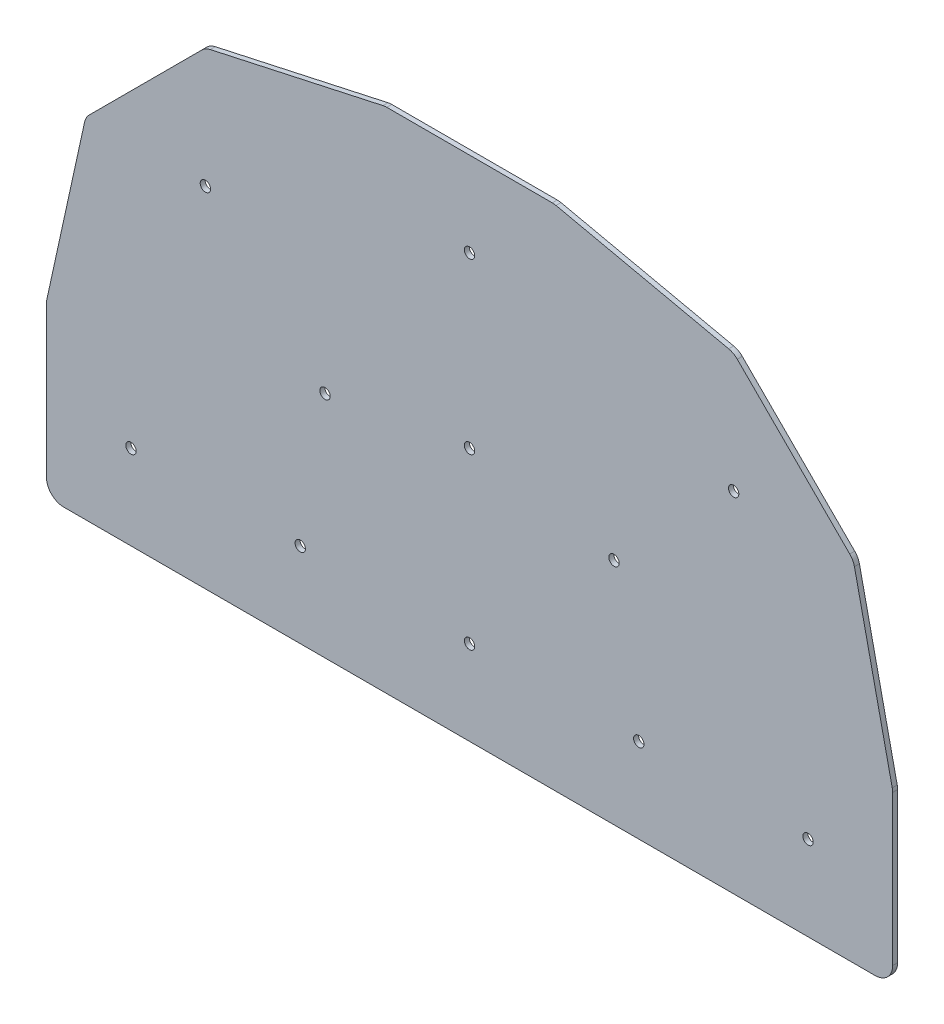
ISO-10303-21;
HEADER;
FILE_DESCRIPTION(('STEP AP214'),'2;1');
FILE_NAME('part.step','',(''),(''),'','','');
FILE_SCHEMA(('AUTOMOTIVE_DESIGN { 1 0 10303 214 1 1 1 1 }'));
ENDSEC;
DATA;
#1=APPLICATION_CONTEXT('core data for automotive mechanical design processes');
#2=APPLICATION_PROTOCOL_DEFINITION('international standard','automotive_design',2000,#1);
#3=PRODUCT_CONTEXT('',#1,'mechanical');
#4=PRODUCT('Part','Part','',(#3));
#5=PRODUCT_RELATED_PRODUCT_CATEGORY('part','',(#4));
#6=PRODUCT_DEFINITION_FORMATION('','',#4);
#7=PRODUCT_DEFINITION_CONTEXT('part definition',#1,'design');
#8=PRODUCT_DEFINITION('design','',#6,#7);
#9=PRODUCT_DEFINITION_SHAPE('','',#8);
#10=(LENGTH_UNIT() NAMED_UNIT(*) SI_UNIT(.MILLI.,.METRE.));
#11=(NAMED_UNIT(*) PLANE_ANGLE_UNIT() SI_UNIT($,.RADIAN.));
#12=(NAMED_UNIT(*) SI_UNIT($,.STERADIAN.) SOLID_ANGLE_UNIT());
#13=UNCERTAINTY_MEASURE_WITH_UNIT(LENGTH_MEASURE(1.E-05),#10,'distance_accuracy_value','');
#14=(GEOMETRIC_REPRESENTATION_CONTEXT(3) GLOBAL_UNCERTAINTY_ASSIGNED_CONTEXT((#13)) GLOBAL_UNIT_ASSIGNED_CONTEXT((#10,
#11,#12)) REPRESENTATION_CONTEXT('',''));
#15=CARTESIAN_POINT('',(0.,0.,0.));
#16=DIRECTION('',(0.,0.,1.));
#17=DIRECTION('',(1.,0.,0.));
#18=AXIS2_PLACEMENT_3D('',#15,#16,#17);
#19=CARTESIAN_POINT('',(129.38125,5.55625,1.5875));
#20=DIRECTION('',(0.,0.,-1.));
#21=DIRECTION('',(-1.,0.,0.));
#22=AXIS2_PLACEMENT_3D('',#19,#20,#21);
#23=CYLINDRICAL_SURFACE('',#22,5.55624999999999);
#24=CARTESIAN_POINT('',(129.38125,5.55625,0.));
#25=DIRECTION('',(0.,0.,-1.));
#26=DIRECTION('',(-1.,0.,0.));
#27=AXIS2_PLACEMENT_3D('',#24,#25,#26);
#28=CIRCLE('',#27,5.55624999999999);
#29=CARTESIAN_POINT('',(134.9375,5.55625,0.));
#30=VERTEX_POINT('',#29);
#31=CARTESIAN_POINT('',(129.38125,0.,0.));
#32=VERTEX_POINT('',#31);
#33=EDGE_CURVE('E201',#30,#32,#28,.T.);
#34=ORIENTED_EDGE('',*,*,#33,.F.);
#35=DIRECTION('',(0.,0.,-1.));
#36=VECTOR('',#35,1.);
#37=CARTESIAN_POINT('',(134.9375,5.55625,1.5875));
#38=LINE('',#37,#36);
#39=CARTESIAN_POINT('',(134.9375,5.55625,1.5875));
#40=VERTEX_POINT('',#39);
#41=EDGE_CURVE('E11',#40,#30,#38,.T.);
#42=ORIENTED_EDGE('',*,*,#41,.F.);
#43=CARTESIAN_POINT('',(129.38125,5.55625,1.5875));
#44=DIRECTION('',(0.,0.,-1.));
#45=DIRECTION('',(-1.,0.,0.));
#46=AXIS2_PLACEMENT_3D('',#43,#44,#45);
#47=CIRCLE('',#46,5.55624999999999);
#48=CARTESIAN_POINT('',(129.38125,0.,1.5875));
#49=VERTEX_POINT('',#48);
#50=EDGE_CURVE('E258',#40,#49,#47,.T.);
#51=ORIENTED_EDGE('',*,*,#50,.T.);
#52=DIRECTION('',(0.,0.,-1.));
#53=VECTOR('',#52,1.);
#54=CARTESIAN_POINT('',(129.38125,0.,1.5875));
#55=LINE('',#54,#53);
#56=EDGE_CURVE('E35',#49,#32,#55,.T.);
#57=ORIENTED_EDGE('',*,*,#56,.T.);
#58=EDGE_LOOP('',(#34,#42,#51,#57));
#59=FACE_BOUND('',#58,.T.);
#60=ADVANCED_FACE('F32',(#59),#23,.T.);
#61=CARTESIAN_POINT('',(134.9375,53.3738460334,1.5875));
#62=DIRECTION('',(1.,0.,0.));
#63=DIRECTION('',(0.,0.,-1.));
#64=AXIS2_PLACEMENT_3D('',#61,#62,#63);
#65=PLANE('',#64);
#66=DIRECTION('',(0.,-1.,0.));
#67=VECTOR('',#66,1.);
#68=CARTESIAN_POINT('',(134.9375,53.3738460334,0.));
#69=LINE('',#68,#67);
#70=CARTESIAN_POINT('',(134.9375,53.3738460334,0.));
#71=VERTEX_POINT('',#70);
#72=EDGE_CURVE('E256',#71,#30,#69,.T.);
#73=ORIENTED_EDGE('',*,*,#72,.F.);
#74=DIRECTION('',(0.,0.,-1.));
#75=VECTOR('',#74,1.);
#76=CARTESIAN_POINT('',(134.9375,53.3738460334,1.5875));
#77=LINE('',#76,#75);
#78=CARTESIAN_POINT('',(134.9375,53.3738460334,1.5875));
#79=VERTEX_POINT('',#78);
#80=EDGE_CURVE('E41',#79,#71,#77,.T.);
#81=ORIENTED_EDGE('',*,*,#80,.F.);
#82=DIRECTION('',(0.,-1.,0.));
#83=VECTOR('',#82,1.);
#84=CARTESIAN_POINT('',(134.9375,53.3738460334,1.5875));
#85=LINE('',#84,#83);
#86=EDGE_CURVE('E191',#79,#40,#85,.T.);
#87=ORIENTED_EDGE('',*,*,#86,.T.);
#88=ORIENTED_EDGE('',*,*,#41,.T.);
#89=EDGE_LOOP('',(#73,#81,#87,#88));
#90=FACE_BOUND('',#89,.T.);
#91=ADVANCED_FACE('F294',(#90),#65,.T.);
#92=CARTESIAN_POINT('',(129.381249994601,53.3738460334,1.5875));
#93=DIRECTION('',(0.,0.,-1.));
#94=DIRECTION('',(-1.,0.,0.));
#95=AXIS2_PLACEMENT_3D('',#92,#93,#94);
#96=CYLINDRICAL_SURFACE('',#95,5.55625000539878);
#97=CARTESIAN_POINT('',(129.381249994601,53.3738460334,0.));
#98=DIRECTION('',(0.,0.,-1.));
#99=DIRECTION('',(-1.,0.,0.));
#100=AXIS2_PLACEMENT_3D('',#97,#98,#99);
#101=CIRCLE('',#100,5.55625000539878);
#102=CARTESIAN_POINT('',(134.808922399283,54.5622425959787,0.));
#103=VERTEX_POINT('',#102);
#104=EDGE_CURVE('E178',#103,#71,#101,.T.);
#105=ORIENTED_EDGE('',*,*,#104,.F.);
#106=DIRECTION('',(0.,0.,-1.));
#107=VECTOR('',#106,1.);
#108=CARTESIAN_POINT('',(134.808922399283,54.5622425959787,1.5875));
#109=LINE('',#108,#107);
#110=CARTESIAN_POINT('',(134.808922399283,54.5622425959787,1.5875));
#111=VERTEX_POINT('',#110);
#112=EDGE_CURVE('E173',#111,#103,#109,.T.);
#113=ORIENTED_EDGE('',*,*,#112,.F.);
#114=CARTESIAN_POINT('',(129.381249994601,53.3738460334,1.5875));
#115=DIRECTION('',(0.,0.,-1.));
#116=DIRECTION('',(-1.,0.,0.));
#117=AXIS2_PLACEMENT_3D('',#114,#115,#116);
#118=CIRCLE('',#117,5.55625000539878);
#119=EDGE_CURVE('E176',#111,#79,#118,.T.);
#120=ORIENTED_EDGE('',*,*,#119,.T.);
#121=ORIENTED_EDGE('',*,*,#80,.T.);
#122=EDGE_LOOP('',(#105,#113,#120,#121));
#123=FACE_BOUND('',#122,.T.);
#124=ADVANCED_FACE('F175',(#123),#96,.T.);
#125=CARTESIAN_POINT('',(122.750794564556,109.634404331843,1.5875));
#126=DIRECTION('',(0.976858924527881,0.213884645475622,0.));
#127=DIRECTION('',(-0.213884645475622,0.97685892452788,0.));
#128=AXIS2_PLACEMENT_3D('',#125,#126,#127);
#129=PLANE('',#128);
#130=DIRECTION('',(0.213884645475622,-0.97685892452788,0.));
#131=VECTOR('',#130,1.);
#132=CARTESIAN_POINT('',(122.750794564556,109.634404331843,0.));
#133=LINE('',#132,#131);
#134=CARTESIAN_POINT('',(122.750794564556,109.634404331843,0.));
#135=VERTEX_POINT('',#134);
#136=EDGE_CURVE('E253',#135,#103,#133,.T.);
#137=ORIENTED_EDGE('',*,*,#136,.F.);
#138=DIRECTION('',(0.,0.,-1.));
#139=VECTOR('',#138,1.);
#140=CARTESIAN_POINT('',(122.750794564556,109.634404331843,1.5875));
#141=LINE('',#140,#139);
#142=CARTESIAN_POINT('',(122.750794564556,109.634404331843,1.5875));
#143=VERTEX_POINT('',#142);
#144=EDGE_CURVE('E183',#143,#135,#141,.T.);
#145=ORIENTED_EDGE('',*,*,#144,.F.);
#146=DIRECTION('',(0.213884645475622,-0.97685892452788,0.));
#147=VECTOR('',#146,1.);
#148=CARTESIAN_POINT('',(122.750794564556,109.634404331843,1.5875));
#149=LINE('',#148,#147);
#150=EDGE_CURVE('E189',#143,#111,#149,.T.);
#151=ORIENTED_EDGE('',*,*,#150,.T.);
#152=ORIENTED_EDGE('',*,*,#112,.T.);
#153=EDGE_LOOP('',(#137,#145,#151,#152));
#154=FACE_BOUND('',#153,.T.);
#155=ADVANCED_FACE('F193',(#154),#129,.T.);
#156=CARTESIAN_POINT('',(117.323122161812,108.446007769689,1.5875));
#157=DIRECTION('',(0.,0.,-1.));
#158=DIRECTION('',(-1.,0.,0.));
#159=AXIS2_PLACEMENT_3D('',#156,#157,#158);
#160=CYLINDRICAL_SURFACE('',#159,5.55625000341466);
#161=CARTESIAN_POINT('',(117.323122161812,108.446007769689,0.));
#162=DIRECTION('',(0.,0.,-1.));
#163=DIRECTION('',(-1.,0.,0.));
#164=AXIS2_PLACEMENT_3D('',#161,#162,#163);
#165=CIRCLE('',#164,5.55625000341466);
#166=CARTESIAN_POINT('',(121.251984217194,112.374869825071,0.));
#167=VERTEX_POINT('',#166);
#168=EDGE_CURVE('E250',#167,#135,#165,.T.);
#169=ORIENTED_EDGE('',*,*,#168,.F.);
#170=DIRECTION('',(0.,0.,-1.));
#171=VECTOR('',#170,1.);
#172=CARTESIAN_POINT('',(121.251984217194,112.374869825071,1.5875));
#173=LINE('',#172,#171);
#174=CARTESIAN_POINT('',(121.251984217194,112.374869825071,1.5875));
#175=VERTEX_POINT('',#174);
#176=EDGE_CURVE('E262',#175,#167,#173,.T.);
#177=ORIENTED_EDGE('',*,*,#176,.F.);
#178=CARTESIAN_POINT('',(117.323122161812,108.446007769689,1.5875));
#179=DIRECTION('',(0.,0.,-1.));
#180=DIRECTION('',(-1.,0.,0.));
#181=AXIS2_PLACEMENT_3D('',#178,#179,#180);
#182=CIRCLE('',#181,5.55625000341466);
#183=EDGE_CURVE('E194',#175,#143,#182,.T.);
#184=ORIENTED_EDGE('',*,*,#183,.T.);
#185=ORIENTED_EDGE('',*,*,#144,.T.);
#186=EDGE_LOOP('',(#169,#177,#184,#185));
#187=FACE_BOUND('',#186,.T.);
#188=ADVANCED_FACE('F307',(#187),#160,.T.);
#189=CARTESIAN_POINT('',(85.3873698149944,148.239484227271,1.5875));
#190=DIRECTION('',(0.707106781186547,0.707106781186548,0.));
#191=DIRECTION('',(-0.707106781186548,0.707106781186547,0.));
#192=AXIS2_PLACEMENT_3D('',#189,#190,#191);
#193=PLANE('',#192);
#194=DIRECTION('',(0.707106781186548,-0.707106781186547,0.));
#195=VECTOR('',#194,1.);
#196=CARTESIAN_POINT('',(85.3873698149944,148.239484227271,0.));
#197=LINE('',#196,#195);
#198=CARTESIAN_POINT('',(85.3873698149944,148.239484227271,0.));
#199=VERTEX_POINT('',#198);
#200=EDGE_CURVE('E247',#199,#167,#197,.T.);
#201=ORIENTED_EDGE('',*,*,#200,.F.);
#202=DIRECTION('',(0.,0.,-1.));
#203=VECTOR('',#202,1.);
#204=CARTESIAN_POINT('',(85.3873698149944,148.239484227271,1.5875));
#205=LINE('',#204,#203);
#206=CARTESIAN_POINT('',(85.3873698149944,148.239484227271,1.5875));
#207=VERTEX_POINT('',#206);
#208=EDGE_CURVE('E264',#207,#199,#205,.T.);
#209=ORIENTED_EDGE('',*,*,#208,.F.);
#210=DIRECTION('',(0.707106781186548,-0.707106781186547,0.));
#211=VECTOR('',#210,1.);
#212=CARTESIAN_POINT('',(85.3873698149944,148.239484227271,1.5875));
#213=LINE('',#212,#211);
#214=EDGE_CURVE('E196',#207,#175,#213,.T.);
#215=ORIENTED_EDGE('',*,*,#214,.T.);
#216=ORIENTED_EDGE('',*,*,#176,.T.);
#217=EDGE_LOOP('',(#201,#209,#215,#216));
#218=FACE_BOUND('',#217,.T.);
#219=ADVANCED_FACE('F310',(#218),#193,.T.);
#220=CARTESIAN_POINT('',(81.4585077593968,144.310622171673,1.5875));
#221=DIRECTION('',(0.,0.,-1.));
#222=DIRECTION('',(-1.,0.,0.));
#223=AXIS2_PLACEMENT_3D('',#220,#221,#222);
#224=CYLINDRICAL_SURFACE('',#223,5.55625000371916);
#225=CARTESIAN_POINT('',(81.4585077593968,144.310622171673,0.));
#226=DIRECTION('',(0.,0.,-1.));
#227=DIRECTION('',(-1.,0.,0.));
#228=AXIS2_PLACEMENT_3D('',#225,#226,#227);
#229=CIRCLE('',#228,5.55625000371916);
#230=CARTESIAN_POINT('',(82.6469043208382,149.738294574885,0.));
#231=VERTEX_POINT('',#230);
#232=EDGE_CURVE('E244',#231,#199,#229,.T.);
#233=ORIENTED_EDGE('',*,*,#232,.F.);
#234=DIRECTION('',(0.,0.,-1.));
#235=VECTOR('',#234,1.);
#236=CARTESIAN_POINT('',(82.6469043208382,149.738294574885,1.5875));
#237=LINE('',#236,#235);
#238=CARTESIAN_POINT('',(82.6469043208382,149.738294574885,1.5875));
#239=VERTEX_POINT('',#238);
#240=EDGE_CURVE('E266',#239,#231,#237,.T.);
#241=ORIENTED_EDGE('',*,*,#240,.F.);
#242=CARTESIAN_POINT('',(81.4585077593968,144.310622171673,1.5875));
#243=DIRECTION('',(0.,0.,-1.));
#244=DIRECTION('',(-1.,0.,0.));
#245=AXIS2_PLACEMENT_3D('',#242,#243,#244);
#246=CIRCLE('',#245,5.55625000371916);
#247=EDGE_CURVE('E530',#239,#207,#246,.T.);
#248=ORIENTED_EDGE('',*,*,#247,.T.);
#249=ORIENTED_EDGE('',*,*,#208,.T.);
#250=EDGE_LOOP('',(#233,#241,#248,#249));
#251=FACE_BOUND('',#250,.T.);
#252=ADVANCED_FACE('F314',(#251),#224,.T.);
#253=CARTESIAN_POINT('',(27.5747425832454,161.796422401718,1.5875));
#254=DIRECTION('',(0.213884645335597,0.976858924558539,0.));
#255=DIRECTION('',(-0.97685892455854,0.213884645335597,0.));
#256=AXIS2_PLACEMENT_3D('',#253,#254,#255);
#257=PLANE('',#256);
#258=DIRECTION('',(0.976858924558539,-0.213884645335597,0.));
#259=VECTOR('',#258,1.);
#260=CARTESIAN_POINT('',(27.5747425832454,161.796422401718,0.));
#261=LINE('',#260,#259);
#262=CARTESIAN_POINT('',(27.5747425832454,161.796422401718,0.));
#263=VERTEX_POINT('',#262);
#264=EDGE_CURVE('E241',#263,#231,#261,.T.);
#265=ORIENTED_EDGE('',*,*,#264,.F.);
#266=DIRECTION('',(0.,0.,-1.));
#267=VECTOR('',#266,1.);
#268=CARTESIAN_POINT('',(27.5747425832454,161.796422401718,1.5875));
#269=LINE('',#268,#267);
#270=CARTESIAN_POINT('',(27.5747425832454,161.796422401718,1.5875));
#271=VERTEX_POINT('',#270);
#272=EDGE_CURVE('E268',#271,#263,#269,.T.);
#273=ORIENTED_EDGE('',*,*,#272,.F.);
#274=DIRECTION('',(0.976858924558539,-0.213884645335597,0.));
#275=VECTOR('',#274,1.);
#276=CARTESIAN_POINT('',(27.5747425832454,161.796422401718,1.5875));
#277=LINE('',#276,#275);
#278=EDGE_CURVE('E527',#271,#239,#277,.T.);
#279=ORIENTED_EDGE('',*,*,#278,.T.);
#280=ORIENTED_EDGE('',*,*,#240,.T.);
#281=EDGE_LOOP('',(#265,#273,#279,#280));
#282=FACE_BOUND('',#281,.T.);
#283=ADVANCED_FACE('F318',(#282),#257,.T.);
#284=CARTESIAN_POINT('',(26.3863460220221,156.368749999503,1.5875));
#285=DIRECTION('',(0.,0.,-1.));
#286=DIRECTION('',(-1.,0.,0.));
#287=AXIS2_PLACEMENT_3D('',#284,#285,#286);
#288=CYLINDRICAL_SURFACE('',#287,5.55625000269937);
#289=CARTESIAN_POINT('',(26.3863460220221,156.368749999503,0.));
#290=DIRECTION('',(0.,0.,-1.));
#291=DIRECTION('',(-1.,0.,0.));
#292=AXIS2_PLACEMENT_3D('',#289,#290,#291);
#293=CIRCLE('',#292,5.55625000269937);
#294=CARTESIAN_POINT('',(26.3863460220221,161.925000002202,0.));
#295=VERTEX_POINT('',#294);
#296=EDGE_CURVE('E238',#295,#263,#293,.T.);
#297=ORIENTED_EDGE('',*,*,#296,.F.);
#298=DIRECTION('',(0.,0.,-1.));
#299=VECTOR('',#298,1.);
#300=CARTESIAN_POINT('',(26.3863460220221,161.925000002202,1.5875));
#301=LINE('',#300,#299);
#302=CARTESIAN_POINT('',(26.3863460220221,161.925000002202,1.5875));
#303=VERTEX_POINT('',#302);
#304=EDGE_CURVE('E270',#303,#295,#301,.T.);
#305=ORIENTED_EDGE('',*,*,#304,.F.);
#306=CARTESIAN_POINT('',(26.3863460220221,156.368749999503,1.5875));
#307=DIRECTION('',(0.,0.,-1.));
#308=DIRECTION('',(-1.,0.,0.));
#309=AXIS2_PLACEMENT_3D('',#306,#307,#308);
#310=CIRCLE('',#309,5.55625000269937);
#311=EDGE_CURVE('E524',#303,#271,#310,.T.);
#312=ORIENTED_EDGE('',*,*,#311,.T.);
#313=ORIENTED_EDGE('',*,*,#272,.T.);
#314=EDGE_LOOP('',(#297,#305,#312,#313));
#315=FACE_BOUND('',#314,.T.);
#316=ADVANCED_FACE('F322',(#315),#288,.T.);
#317=CARTESIAN_POINT('',(-26.3863460447779,161.925000002202,1.5875));
#318=DIRECTION('',(0.,1.,0.));
#319=DIRECTION('',(-1.,0.,0.));
#320=AXIS2_PLACEMENT_3D('',#317,#318,#319);
#321=PLANE('',#320);
#322=DIRECTION('',(1.,0.,0.));
#323=VECTOR('',#322,1.);
#324=CARTESIAN_POINT('',(-26.3863460447779,161.925000002202,0.));
#325=LINE('',#324,#323);
#326=CARTESIAN_POINT('',(-26.3863460447779,161.925000002202,0.));
#327=VERTEX_POINT('',#326);
#328=EDGE_CURVE('E235',#327,#295,#325,.T.);
#329=ORIENTED_EDGE('',*,*,#328,.F.);
#330=DIRECTION('',(0.,0.,-1.));
#331=VECTOR('',#330,1.);
#332=CARTESIAN_POINT('',(-26.3863460447779,161.925000002202,1.5875));
#333=LINE('',#332,#331);
#334=CARTESIAN_POINT('',(-26.3863460447779,161.925000002202,1.5875));
#335=VERTEX_POINT('',#334);
#336=EDGE_CURVE('E272',#335,#327,#333,.T.);
#337=ORIENTED_EDGE('',*,*,#336,.F.);
#338=DIRECTION('',(1.,0.,0.));
#339=VECTOR('',#338,1.);
#340=CARTESIAN_POINT('',(-26.3863460447779,161.925000002202,1.5875));
#341=LINE('',#340,#339);
#342=EDGE_CURVE('E521',#335,#303,#341,.T.);
#343=ORIENTED_EDGE('',*,*,#342,.T.);
#344=ORIENTED_EDGE('',*,*,#304,.T.);
#345=EDGE_LOOP('',(#329,#337,#343,#344));
#346=FACE_BOUND('',#345,.T.);
#347=ADVANCED_FACE('F326',(#346),#321,.T.);
#348=CARTESIAN_POINT('',(-26.3863460447779,156.368749996803,1.5875));
#349=DIRECTION('',(0.,0.,-1.));
#350=DIRECTION('',(-1.,0.,0.));
#351=AXIS2_PLACEMENT_3D('',#348,#349,#350);
#352=CYLINDRICAL_SURFACE('',#351,5.55625000539877);
#353=CARTESIAN_POINT('',(-26.3863460447779,156.368749996803,0.));
#354=DIRECTION('',(0.,0.,-1.));
#355=DIRECTION('',(-1.,0.,0.));
#356=AXIS2_PLACEMENT_3D('',#353,#354,#355);
#357=CIRCLE('',#356,5.55625000539877);
#358=CARTESIAN_POINT('',(-27.5747426073565,161.796422401485,0.));
#359=VERTEX_POINT('',#358);
#360=EDGE_CURVE('E232',#359,#327,#357,.T.);
#361=ORIENTED_EDGE('',*,*,#360,.F.);
#362=DIRECTION('',(0.,0.,-1.));
#363=VECTOR('',#362,1.);
#364=CARTESIAN_POINT('',(-27.5747426073565,161.796422401485,1.5875));
#365=LINE('',#364,#363);
#366=CARTESIAN_POINT('',(-27.5747426073565,161.796422401485,1.5875));
#367=VERTEX_POINT('',#366);
#368=EDGE_CURVE('E274',#367,#359,#365,.T.);
#369=ORIENTED_EDGE('',*,*,#368,.F.);
#370=CARTESIAN_POINT('',(-26.3863460447779,156.368749996803,1.5875));
#371=DIRECTION('',(0.,0.,-1.));
#372=DIRECTION('',(-1.,0.,0.));
#373=AXIS2_PLACEMENT_3D('',#370,#371,#372);
#374=CIRCLE('',#373,5.55625000539877);
#375=EDGE_CURVE('E518',#367,#335,#374,.T.);
#376=ORIENTED_EDGE('',*,*,#375,.T.);
#377=ORIENTED_EDGE('',*,*,#336,.T.);
#378=EDGE_LOOP('',(#361,#369,#376,#377));
#379=FACE_BOUND('',#378,.T.);
#380=ADVANCED_FACE('F330',(#379),#352,.T.);
#381=CARTESIAN_POINT('',(-82.6469043432209,149.738294566758,1.5875));
#382=DIRECTION('',(-0.213884645475622,0.976858924527881,0.));
#383=DIRECTION('',(-0.97685892452788,-0.213884645475622,0.));
#384=AXIS2_PLACEMENT_3D('',#381,#382,#383);
#385=PLANE('',#384);
#386=DIRECTION('',(0.97685892452788,0.213884645475622,0.));
#387=VECTOR('',#386,1.);
#388=CARTESIAN_POINT('',(-82.6469043432209,149.738294566758,0.));
#389=LINE('',#388,#387);
#390=CARTESIAN_POINT('',(-82.6469043432209,149.738294566758,0.));
#391=VERTEX_POINT('',#390);
#392=EDGE_CURVE('E229',#391,#359,#389,.T.);
#393=ORIENTED_EDGE('',*,*,#392,.F.);
#394=DIRECTION('',(0.,0.,-1.));
#395=VECTOR('',#394,1.);
#396=CARTESIAN_POINT('',(-82.6469043432209,149.738294566758,1.5875));
#397=LINE('',#396,#395);
#398=CARTESIAN_POINT('',(-82.6469043432209,149.738294566758,1.5875));
#399=VERTEX_POINT('',#398);
#400=EDGE_CURVE('E276',#399,#391,#397,.T.);
#401=ORIENTED_EDGE('',*,*,#400,.F.);
#402=DIRECTION('',(0.97685892452788,0.213884645475622,0.));
#403=VECTOR('',#402,1.);
#404=CARTESIAN_POINT('',(-82.6469043432209,149.738294566758,1.5875));
#405=LINE('',#404,#403);
#406=EDGE_CURVE('E515',#399,#367,#405,.T.);
#407=ORIENTED_EDGE('',*,*,#406,.T.);
#408=ORIENTED_EDGE('',*,*,#368,.T.);
#409=EDGE_LOOP('',(#393,#401,#407,#408));
#410=FACE_BOUND('',#409,.T.);
#411=ADVANCED_FACE('F334',(#410),#385,.T.);
#412=CARTESIAN_POINT('',(-81.4585077810666,144.310622164014,1.5875));
#413=DIRECTION('',(0.,0.,-1.));
#414=DIRECTION('',(-1.,0.,0.));
#415=AXIS2_PLACEMENT_3D('',#412,#413,#414);
#416=CYLINDRICAL_SURFACE('',#415,5.55625000341462);
#417=CARTESIAN_POINT('',(-81.4585077810666,144.310622164014,0.));
#418=DIRECTION('',(0.,0.,-1.));
#419=DIRECTION('',(-1.,0.,0.));
#420=AXIS2_PLACEMENT_3D('',#417,#418,#419);
#421=CIRCLE('',#420,5.55625000341462);
#422=CARTESIAN_POINT('',(-85.3873698364489,148.239484219396,0.));
#423=VERTEX_POINT('',#422);
#424=EDGE_CURVE('E226',#423,#391,#421,.T.);
#425=ORIENTED_EDGE('',*,*,#424,.F.);
#426=DIRECTION('',(0.,0.,-1.));
#427=VECTOR('',#426,1.);
#428=CARTESIAN_POINT('',(-85.3873698364489,148.239484219396,1.5875));
#429=LINE('',#428,#427);
#430=CARTESIAN_POINT('',(-85.3873698364489,148.239484219396,1.5875));
#431=VERTEX_POINT('',#430);
#432=EDGE_CURVE('E278',#431,#423,#429,.T.);
#433=ORIENTED_EDGE('',*,*,#432,.F.);
#434=CARTESIAN_POINT('',(-81.4585077810666,144.310622164014,1.5875));
#435=DIRECTION('',(0.,0.,-1.));
#436=DIRECTION('',(-1.,0.,0.));
#437=AXIS2_PLACEMENT_3D('',#434,#435,#436);
#438=CIRCLE('',#437,5.55625000341462);
#439=EDGE_CURVE('E512',#431,#399,#438,.T.);
#440=ORIENTED_EDGE('',*,*,#439,.T.);
#441=ORIENTED_EDGE('',*,*,#400,.T.);
#442=EDGE_LOOP('',(#425,#433,#440,#441));
#443=FACE_BOUND('',#442,.T.);
#444=ADVANCED_FACE('F338',(#443),#416,.T.);
#445=CARTESIAN_POINT('',(-121.251984238649,112.374869817196,1.5875));
#446=DIRECTION('',(-0.707106781186547,0.707106781186548,0.));
#447=DIRECTION('',(-0.707106781186548,-0.707106781186547,0.));
#448=AXIS2_PLACEMENT_3D('',#445,#446,#447);
#449=PLANE('',#448);
#450=DIRECTION('',(0.707106781186548,0.707106781186547,0.));
#451=VECTOR('',#450,1.);
#452=CARTESIAN_POINT('',(-121.251984238649,112.374869817196,0.));
#453=LINE('',#452,#451);
#454=CARTESIAN_POINT('',(-121.251984238649,112.374869817196,0.));
#455=VERTEX_POINT('',#454);
#456=EDGE_CURVE('E223',#455,#423,#453,.T.);
#457=ORIENTED_EDGE('',*,*,#456,.F.);
#458=DIRECTION('',(0.,0.,-1.));
#459=VECTOR('',#458,1.);
#460=CARTESIAN_POINT('',(-121.251984238649,112.374869817196,1.5875));
#461=LINE('',#460,#459);
#462=CARTESIAN_POINT('',(-121.251984238649,112.374869817196,1.5875));
#463=VERTEX_POINT('',#462);
#464=EDGE_CURVE('E280',#463,#455,#461,.T.);
#465=ORIENTED_EDGE('',*,*,#464,.F.);
#466=DIRECTION('',(0.707106781186548,0.707106781186547,0.));
#467=VECTOR('',#466,1.);
#468=CARTESIAN_POINT('',(-121.251984238649,112.374869817196,1.5875));
#469=LINE('',#468,#467);
#470=EDGE_CURVE('E509',#463,#431,#469,.T.);
#471=ORIENTED_EDGE('',*,*,#470,.T.);
#472=ORIENTED_EDGE('',*,*,#432,.T.);
#473=EDGE_LOOP('',(#457,#465,#471,#472));
#474=FACE_BOUND('',#473,.T.);
#475=ADVANCED_FACE('F342',(#474),#449,.T.);
#476=CARTESIAN_POINT('',(-117.323122183051,108.446007761599,1.5875));
#477=DIRECTION('',(0.,0.,-1.));
#478=DIRECTION('',(-1.,0.,0.));
#479=AXIS2_PLACEMENT_3D('',#476,#477,#478);
#480=CYLINDRICAL_SURFACE('',#479,5.55625000371917);
#481=CARTESIAN_POINT('',(-117.323122183051,108.446007761599,0.));
#482=DIRECTION('',(0.,0.,-1.));
#483=DIRECTION('',(-1.,0.,0.));
#484=AXIS2_PLACEMENT_3D('',#481,#482,#483);
#485=CIRCLE('',#484,5.55625000371917);
#486=CARTESIAN_POINT('',(-122.750794586263,109.63440432304,0.));
#487=VERTEX_POINT('',#486);
#488=EDGE_CURVE('E220',#487,#455,#485,.T.);
#489=ORIENTED_EDGE('',*,*,#488,.F.);
#490=DIRECTION('',(0.,0.,-1.));
#491=VECTOR('',#490,1.);
#492=CARTESIAN_POINT('',(-122.750794586263,109.63440432304,1.5875));
#493=LINE('',#492,#491);
#494=CARTESIAN_POINT('',(-122.750794586263,109.63440432304,1.5875));
#495=VERTEX_POINT('',#494);
#496=EDGE_CURVE('E282',#495,#487,#493,.T.);
#497=ORIENTED_EDGE('',*,*,#496,.F.);
#498=CARTESIAN_POINT('',(-117.323122183051,108.446007761599,1.5875));
#499=DIRECTION('',(0.,0.,-1.));
#500=DIRECTION('',(-1.,0.,0.));
#501=AXIS2_PLACEMENT_3D('',#498,#499,#500);
#502=CIRCLE('',#501,5.55625000371917);
#503=EDGE_CURVE('E506',#495,#463,#502,.T.);
#504=ORIENTED_EDGE('',*,*,#503,.T.);
#505=ORIENTED_EDGE('',*,*,#464,.T.);
#506=EDGE_LOOP('',(#489,#497,#504,#505));
#507=FACE_BOUND('',#506,.T.);
#508=ADVANCED_FACE('F346',(#507),#480,.T.);
#509=CARTESIAN_POINT('',(-134.808922399516,54.56224264747,1.5875));
#510=DIRECTION('',(-0.97685892455854,0.213884645335596,0.));
#511=DIRECTION('',(-0.213884645335596,-0.97685892455854,0.));
#512=AXIS2_PLACEMENT_3D('',#509,#510,#511);
#513=PLANE('',#512);
#514=DIRECTION('',(0.213884645335596,0.97685892455854,0.));
#515=VECTOR('',#514,1.);
#516=CARTESIAN_POINT('',(-134.808922399516,54.56224264747,0.));
#517=LINE('',#516,#515);
#518=CARTESIAN_POINT('',(-134.808922399516,54.56224264747,0.));
#519=VERTEX_POINT('',#518);
#520=EDGE_CURVE('E217',#519,#487,#517,.T.);
#521=ORIENTED_EDGE('',*,*,#520,.F.);
#522=DIRECTION('',(0.,0.,-1.));
#523=VECTOR('',#522,1.);
#524=CARTESIAN_POINT('',(-134.808922399516,54.56224264747,1.5875));
#525=LINE('',#524,#523);
#526=CARTESIAN_POINT('',(-134.808922399516,54.56224264747,1.5875));
#527=VERTEX_POINT('',#526);
#528=EDGE_CURVE('E284',#527,#519,#525,.T.);
#529=ORIENTED_EDGE('',*,*,#528,.F.);
#530=DIRECTION('',(0.213884645335596,0.97685892455854,0.));
#531=VECTOR('',#530,1.);
#532=CARTESIAN_POINT('',(-134.808922399516,54.56224264747,1.5875));
#533=LINE('',#532,#531);
#534=EDGE_CURVE('E503',#527,#495,#533,.T.);
#535=ORIENTED_EDGE('',*,*,#534,.T.);
#536=ORIENTED_EDGE('',*,*,#496,.T.);
#537=EDGE_LOOP('',(#521,#529,#535,#536));
#538=FACE_BOUND('',#537,.T.);
#539=ADVANCED_FACE('F350',(#538),#513,.T.);
#540=CARTESIAN_POINT('',(-129.381249997301,53.3738460862467,1.5875));
#541=DIRECTION('',(0.,0.,-1.));
#542=DIRECTION('',(-1.,0.,0.));
#543=AXIS2_PLACEMENT_3D('',#540,#541,#542);
#544=CYLINDRICAL_SURFACE('',#543,5.55625000269939);
#545=CARTESIAN_POINT('',(-129.381249997301,53.3738460862467,0.));
#546=DIRECTION('',(0.,0.,-1.));
#547=DIRECTION('',(-1.,0.,0.));
#548=AXIS2_PLACEMENT_3D('',#545,#546,#547);
#549=CIRCLE('',#548,5.55625000269939);
#550=CARTESIAN_POINT('',(-134.9375,53.3738460862467,0.));
#551=VERTEX_POINT('',#550);
#552=EDGE_CURVE('E214',#551,#519,#549,.T.);
#553=ORIENTED_EDGE('',*,*,#552,.F.);
#554=DIRECTION('',(0.,0.,-1.));
#555=VECTOR('',#554,1.);
#556=CARTESIAN_POINT('',(-134.9375,53.3738460862467,1.5875));
#557=LINE('',#556,#555);
#558=CARTESIAN_POINT('',(-134.9375,53.3738460862467,1.5875));
#559=VERTEX_POINT('',#558);
#560=EDGE_CURVE('E286',#559,#551,#557,.T.);
#561=ORIENTED_EDGE('',*,*,#560,.F.);
#562=CARTESIAN_POINT('',(-129.381249997301,53.3738460862467,1.5875));
#563=DIRECTION('',(0.,0.,-1.));
#564=DIRECTION('',(-1.,0.,0.));
#565=AXIS2_PLACEMENT_3D('',#562,#563,#564);
#566=CIRCLE('',#565,5.55625000269939);
#567=EDGE_CURVE('E500',#559,#527,#566,.T.);
#568=ORIENTED_EDGE('',*,*,#567,.T.);
#569=ORIENTED_EDGE('',*,*,#528,.T.);
#570=EDGE_LOOP('',(#553,#561,#568,#569));
#571=FACE_BOUND('',#570,.T.);
#572=ADVANCED_FACE('F354',(#571),#544,.T.);
#573=CARTESIAN_POINT('',(-134.9375,5.55625,1.5875));
#574=DIRECTION('',(-1.,0.,0.));
#575=DIRECTION('',(0.,0.,1.));
#576=AXIS2_PLACEMENT_3D('',#573,#574,#575);
#577=PLANE('',#576);
#578=DIRECTION('',(0.,1.,0.));
#579=VECTOR('',#578,1.);
#580=CARTESIAN_POINT('',(-134.9375,5.55625,0.));
#581=LINE('',#580,#579);
#582=CARTESIAN_POINT('',(-134.9375,5.55625,0.));
#583=VERTEX_POINT('',#582);
#584=EDGE_CURVE('E211',#583,#551,#581,.T.);
#585=ORIENTED_EDGE('',*,*,#584,.F.);
#586=DIRECTION('',(0.,0.,-1.));
#587=VECTOR('',#586,1.);
#588=CARTESIAN_POINT('',(-134.9375,5.55625,1.5875));
#589=LINE('',#588,#587);
#590=CARTESIAN_POINT('',(-134.9375,5.55625,1.5875));
#591=VERTEX_POINT('',#590);
#592=EDGE_CURVE('E288',#591,#583,#589,.T.);
#593=ORIENTED_EDGE('',*,*,#592,.F.);
#594=DIRECTION('',(0.,1.,0.));
#595=VECTOR('',#594,1.);
#596=CARTESIAN_POINT('',(-134.9375,5.55625,1.5875));
#597=LINE('',#596,#595);
#598=EDGE_CURVE('E497',#591,#559,#597,.T.);
#599=ORIENTED_EDGE('',*,*,#598,.T.);
#600=ORIENTED_EDGE('',*,*,#560,.T.);
#601=EDGE_LOOP('',(#585,#593,#599,#600));
#602=FACE_BOUND('',#601,.T.);
#603=ADVANCED_FACE('F358',(#602),#577,.T.);
#604=CARTESIAN_POINT('',(-129.38125,5.55625,1.5875));
#605=DIRECTION('',(0.,0.,-1.));
#606=DIRECTION('',(-1.,0.,0.));
#607=AXIS2_PLACEMENT_3D('',#604,#605,#606);
#608=CYLINDRICAL_SURFACE('',#607,5.55624999999999);
#609=CARTESIAN_POINT('',(-129.38125,5.55625,0.));
#610=DIRECTION('',(0.,0.,-1.));
#611=DIRECTION('',(-1.,0.,0.));
#612=AXIS2_PLACEMENT_3D('',#609,#610,#611);
#613=CIRCLE('',#612,5.55624999999999);
#614=CARTESIAN_POINT('',(-129.38125,0.,0.));
#615=VERTEX_POINT('',#614);
#616=EDGE_CURVE('E208',#615,#583,#613,.T.);
#617=ORIENTED_EDGE('',*,*,#616,.F.);
#618=DIRECTION('',(0.,0.,-1.));
#619=VECTOR('',#618,1.);
#620=CARTESIAN_POINT('',(-129.38125,0.,1.5875));
#621=LINE('',#620,#619);
#622=CARTESIAN_POINT('',(-129.38125,0.,1.5875));
#623=VERTEX_POINT('',#622);
#624=EDGE_CURVE('E289',#623,#615,#621,.T.);
#625=ORIENTED_EDGE('',*,*,#624,.F.);
#626=CARTESIAN_POINT('',(-129.38125,5.55625,1.5875));
#627=DIRECTION('',(0.,0.,-1.));
#628=DIRECTION('',(-1.,0.,0.));
#629=AXIS2_PLACEMENT_3D('',#626,#627,#628);
#630=CIRCLE('',#629,5.55624999999999);
#631=EDGE_CURVE('E494',#623,#591,#630,.T.);
#632=ORIENTED_EDGE('',*,*,#631,.T.);
#633=ORIENTED_EDGE('',*,*,#592,.T.);
#634=EDGE_LOOP('',(#617,#625,#632,#633));
#635=FACE_BOUND('',#634,.T.);
#636=ADVANCED_FACE('F362',(#635),#608,.T.);
#637=CARTESIAN_POINT('',(129.38125,0.,1.5875));
#638=DIRECTION('',(0.,-1.,0.));
#639=DIRECTION('',(0.,0.,-1.));
#640=AXIS2_PLACEMENT_3D('',#637,#638,#639);
#641=PLANE('',#640);
#642=DIRECTION('',(-1.,0.,0.));
#643=VECTOR('',#642,1.);
#644=CARTESIAN_POINT('',(129.38125,0.,0.));
#645=LINE('',#644,#643);
#646=EDGE_CURVE('E204',#32,#615,#645,.T.);
#647=ORIENTED_EDGE('',*,*,#646,.F.);
#648=ORIENTED_EDGE('',*,*,#56,.F.);
#649=DIRECTION('',(-1.,0.,0.));
#650=VECTOR('',#649,1.);
#651=CARTESIAN_POINT('',(129.38125,0.,1.5875));
#652=LINE('',#651,#650);
#653=EDGE_CURVE('E492',#49,#623,#652,.T.);
#654=ORIENTED_EDGE('',*,*,#653,.T.);
#655=ORIENTED_EDGE('',*,*,#624,.T.);
#656=EDGE_LOOP('',(#647,#648,#654,#655));
#657=FACE_BOUND('',#656,.T.);
#658=ADVANCED_FACE('F291',(#657),#641,.T.);
#659=CARTESIAN_POINT('',(129.38125,5.55625,1.5875));
#660=DIRECTION('',(0.,0.,-1.));
#661=DIRECTION('',(-1.,0.,0.));
#662=AXIS2_PLACEMENT_3D('',#659,#660,#661);
#663=PLANE('',#662);
#664=CARTESIAN_POINT('',(0.,26.9875,1.5875));
#665=DIRECTION('',(0.,0.,-1.));
#666=DIRECTION('',(1.,0.,0.));
#667=AXIS2_PLACEMENT_3D('',#664,#665,#666);
#668=CIRCLE('',#667,1.651);
#669=CARTESIAN_POINT('',(1.651,26.9875,1.5875));
#670=VERTEX_POINT('',#669);
#671=EDGE_CURVE('E425',#670,#670,#668,.T.);
#672=ORIENTED_EDGE('',*,*,#671,.T.);
#673=EDGE_LOOP('',(#672));
#674=FACE_BOUND('',#673,.T.);
#675=CARTESIAN_POINT('',(0.,134.9375,1.5875));
#676=DIRECTION('',(0.,0.,-1.));
#677=DIRECTION('',(1.,0.,0.));
#678=AXIS2_PLACEMENT_3D('',#675,#676,#677);
#679=CIRCLE('',#678,1.651);
#680=CARTESIAN_POINT('',(1.651,134.9375,1.5875));
#681=VERTEX_POINT('',#680);
#682=EDGE_CURVE('E433',#681,#681,#679,.T.);
#683=ORIENTED_EDGE('',*,*,#682,.T.);
#684=EDGE_LOOP('',(#683));
#685=FACE_BOUND('',#684,.T.);
#686=CARTESIAN_POINT('',(0.,80.9625,1.5875));
#687=DIRECTION('',(0.,0.,-1.));
#688=DIRECTION('',(1.,0.,0.));
#689=AXIS2_PLACEMENT_3D('',#686,#687,#688);
#690=CIRCLE('',#689,1.651);
#691=CARTESIAN_POINT('',(1.651,80.9625,1.5875));
#692=VERTEX_POINT('',#691);
#693=EDGE_CURVE('E439',#692,#692,#690,.T.);
#694=ORIENTED_EDGE('',*,*,#693,.T.);
#695=EDGE_LOOP('',(#694));
#696=FACE_BOUND('',#695,.T.);
#697=CARTESIAN_POINT('',(-107.95,26.9875,1.5875));
#698=DIRECTION('',(0.,0.,-1.));
#699=DIRECTION('',(1.,0.,0.));
#700=AXIS2_PLACEMENT_3D('',#697,#698,#699);
#701=CIRCLE('',#700,1.651);
#702=CARTESIAN_POINT('',(-106.299,26.9875,1.5875));
#703=VERTEX_POINT('',#702);
#704=EDGE_CURVE('E445',#703,#703,#701,.T.);
#705=ORIENTED_EDGE('',*,*,#704,.T.);
#706=EDGE_LOOP('',(#705));
#707=FACE_BOUND('',#706,.T.);
#708=CARTESIAN_POINT('',(107.95,26.9875,1.5875));
#709=DIRECTION('',(0.,0.,-1.));
#710=DIRECTION('',(1.,0.,0.));
#711=AXIS2_PLACEMENT_3D('',#708,#709,#710);
#712=CIRCLE('',#711,1.651);
#713=CARTESIAN_POINT('',(109.601,26.9875,1.5875));
#714=VERTEX_POINT('',#713);
#715=EDGE_CURVE('E451',#714,#714,#712,.T.);
#716=ORIENTED_EDGE('',*,*,#715,.T.);
#717=EDGE_LOOP('',(#716));
#718=FACE_BOUND('',#717,.T.);
#719=CARTESIAN_POINT('',(84.236632771,111.224132771,1.5875));
#720=DIRECTION('',(0.,0.,-1.));
#721=DIRECTION('',(1.,0.,0.));
#722=AXIS2_PLACEMENT_3D('',#719,#720,#721);
#723=CIRCLE('',#722,1.65100000000001);
#724=CARTESIAN_POINT('',(85.887632771,111.224132771,1.5875));
#725=VERTEX_POINT('',#724);
#726=EDGE_CURVE('E457',#725,#725,#723,.T.);
#727=ORIENTED_EDGE('',*,*,#726,.T.);
#728=EDGE_LOOP('',(#727));
#729=FACE_BOUND('',#728,.T.);
#730=CARTESIAN_POINT('',(46.070544257,73.058044257,1.5875));
#731=DIRECTION('',(0.,0.,-1.));
#732=DIRECTION('',(1.,0.,0.));
#733=AXIS2_PLACEMENT_3D('',#730,#731,#732);
#734=CIRCLE('',#733,1.651);
#735=CARTESIAN_POINT('',(47.721544257,73.058044257,1.5875));
#736=VERTEX_POINT('',#735);
#737=EDGE_CURVE('E463',#736,#736,#734,.T.);
#738=ORIENTED_EDGE('',*,*,#737,.T.);
#739=EDGE_LOOP('',(#738));
#740=FACE_BOUND('',#739,.T.);
#741=CARTESIAN_POINT('',(-84.236632771,111.224132771,1.5875));
#742=DIRECTION('',(0.,0.,-1.));
#743=DIRECTION('',(1.,0.,0.));
#744=AXIS2_PLACEMENT_3D('',#741,#742,#743);
#745=CIRCLE('',#744,1.65099999999999);
#746=CARTESIAN_POINT('',(-82.585632771,111.224132771,1.5875));
#747=VERTEX_POINT('',#746);
#748=EDGE_CURVE('E469',#747,#747,#745,.T.);
#749=ORIENTED_EDGE('',*,*,#748,.T.);
#750=EDGE_LOOP('',(#749));
#751=FACE_BOUND('',#750,.T.);
#752=CARTESIAN_POINT('',(-46.070544257,73.058044257,1.5875));
#753=DIRECTION('',(0.,0.,-1.));
#754=DIRECTION('',(1.,0.,0.));
#755=AXIS2_PLACEMENT_3D('',#752,#753,#754);
#756=CIRCLE('',#755,1.65099999999999);
#757=CARTESIAN_POINT('',(-44.419544257,73.058044257,1.5875));
#758=VERTEX_POINT('',#757);
#759=EDGE_CURVE('E475',#758,#758,#756,.T.);
#760=ORIENTED_EDGE('',*,*,#759,.T.);
#761=EDGE_LOOP('',(#760));
#762=FACE_BOUND('',#761,.T.);
#763=CARTESIAN_POINT('',(-53.975,26.9875,1.5875));
#764=DIRECTION('',(0.,0.,-1.));
#765=DIRECTION('',(1.,0.,0.));
#766=AXIS2_PLACEMENT_3D('',#763,#764,#765);
#767=CIRCLE('',#766,1.65099999999999);
#768=CARTESIAN_POINT('',(-52.324,26.9875,1.5875));
#769=VERTEX_POINT('',#768);
#770=EDGE_CURVE('E481',#769,#769,#767,.T.);
#771=ORIENTED_EDGE('',*,*,#770,.T.);
#772=EDGE_LOOP('',(#771));
#773=FACE_BOUND('',#772,.T.);
#774=CARTESIAN_POINT('',(53.975,26.9875,1.5875));
#775=DIRECTION('',(0.,0.,-1.));
#776=DIRECTION('',(1.,0.,0.));
#777=AXIS2_PLACEMENT_3D('',#774,#775,#776);
#778=CIRCLE('',#777,1.651);
#779=CARTESIAN_POINT('',(55.626,26.9875,1.5875));
#780=VERTEX_POINT('',#779);
#781=EDGE_CURVE('E205',#780,#780,#778,.T.);
#782=ORIENTED_EDGE('',*,*,#781,.T.);
#783=EDGE_LOOP('',(#782));
#784=FACE_BOUND('',#783,.T.);
#785=ORIENTED_EDGE('',*,*,#50,.F.);
#786=ORIENTED_EDGE('',*,*,#86,.F.);
#787=ORIENTED_EDGE('',*,*,#119,.F.);
#788=ORIENTED_EDGE('',*,*,#150,.F.);
#789=ORIENTED_EDGE('',*,*,#183,.F.);
#790=ORIENTED_EDGE('',*,*,#214,.F.);
#791=ORIENTED_EDGE('',*,*,#247,.F.);
#792=ORIENTED_EDGE('',*,*,#278,.F.);
#793=ORIENTED_EDGE('',*,*,#311,.F.);
#794=ORIENTED_EDGE('',*,*,#342,.F.);
#795=ORIENTED_EDGE('',*,*,#375,.F.);
#796=ORIENTED_EDGE('',*,*,#406,.F.);
#797=ORIENTED_EDGE('',*,*,#439,.F.);
#798=ORIENTED_EDGE('',*,*,#470,.F.);
#799=ORIENTED_EDGE('',*,*,#503,.F.);
#800=ORIENTED_EDGE('',*,*,#534,.F.);
#801=ORIENTED_EDGE('',*,*,#567,.F.);
#802=ORIENTED_EDGE('',*,*,#598,.F.);
#803=ORIENTED_EDGE('',*,*,#631,.F.);
#804=ORIENTED_EDGE('',*,*,#653,.F.);
#805=EDGE_LOOP('',(#785,#786,#787,#788,#789,#790,#791,#792,#793,#794,#795,#796,#797,#798,#799,
#800,#801,#802,#803,#804));
#806=FACE_BOUND('',#805,.T.);
#807=ADVANCED_FACE('F187',(#674,#685,#696,#707,#718,#729,#740,#751,#762,#773,#784,#806),#663,.F.);
#808=CARTESIAN_POINT('',(129.38125,5.55625,0.));
#809=DIRECTION('',(0.,0.,-1.));
#810=DIRECTION('',(-1.,0.,0.));
#811=AXIS2_PLACEMENT_3D('',#808,#809,#810);
#812=PLANE('',#811);
#813=CARTESIAN_POINT('',(0.,26.9875,0.));
#814=DIRECTION('',(0.,0.,-1.));
#815=DIRECTION('',(1.,0.,0.));
#816=AXIS2_PLACEMENT_3D('',#813,#814,#815);
#817=CIRCLE('',#816,1.651);
#818=CARTESIAN_POINT('',(1.651,26.9875,0.));
#819=VERTEX_POINT('',#818);
#820=EDGE_CURVE('E428',#819,#819,#817,.T.);
#821=ORIENTED_EDGE('',*,*,#820,.F.);
#822=EDGE_LOOP('',(#821));
#823=FACE_BOUND('',#822,.T.);
#824=CARTESIAN_POINT('',(0.,134.9375,0.));
#825=DIRECTION('',(0.,0.,-1.));
#826=DIRECTION('',(1.,0.,0.));
#827=AXIS2_PLACEMENT_3D('',#824,#825,#826);
#828=CIRCLE('',#827,1.651);
#829=CARTESIAN_POINT('',(1.651,134.9375,0.));
#830=VERTEX_POINT('',#829);
#831=EDGE_CURVE('E430',#830,#830,#828,.T.);
#832=ORIENTED_EDGE('',*,*,#831,.F.);
#833=EDGE_LOOP('',(#832));
#834=FACE_BOUND('',#833,.T.);
#835=CARTESIAN_POINT('',(0.,80.9625,0.));
#836=DIRECTION('',(0.,0.,-1.));
#837=DIRECTION('',(1.,0.,0.));
#838=AXIS2_PLACEMENT_3D('',#835,#836,#837);
#839=CIRCLE('',#838,1.651);
#840=CARTESIAN_POINT('',(1.651,80.9625,0.));
#841=VERTEX_POINT('',#840);
#842=EDGE_CURVE('E436',#841,#841,#839,.T.);
#843=ORIENTED_EDGE('',*,*,#842,.F.);
#844=EDGE_LOOP('',(#843));
#845=FACE_BOUND('',#844,.T.);
#846=CARTESIAN_POINT('',(-107.95,26.9875,0.));
#847=DIRECTION('',(0.,0.,-1.));
#848=DIRECTION('',(1.,0.,0.));
#849=AXIS2_PLACEMENT_3D('',#846,#847,#848);
#850=CIRCLE('',#849,1.651);
#851=CARTESIAN_POINT('',(-106.299,26.9875,0.));
#852=VERTEX_POINT('',#851);
#853=EDGE_CURVE('E442',#852,#852,#850,.T.);
#854=ORIENTED_EDGE('',*,*,#853,.F.);
#855=EDGE_LOOP('',(#854));
#856=FACE_BOUND('',#855,.T.);
#857=CARTESIAN_POINT('',(107.95,26.9875,0.));
#858=DIRECTION('',(0.,0.,-1.));
#859=DIRECTION('',(1.,0.,0.));
#860=AXIS2_PLACEMENT_3D('',#857,#858,#859);
#861=CIRCLE('',#860,1.651);
#862=CARTESIAN_POINT('',(109.601,26.9875,0.));
#863=VERTEX_POINT('',#862);
#864=EDGE_CURVE('E448',#863,#863,#861,.T.);
#865=ORIENTED_EDGE('',*,*,#864,.F.);
#866=EDGE_LOOP('',(#865));
#867=FACE_BOUND('',#866,.T.);
#868=CARTESIAN_POINT('',(84.236632771,111.224132771,0.));
#869=DIRECTION('',(0.,0.,-1.));
#870=DIRECTION('',(1.,0.,0.));
#871=AXIS2_PLACEMENT_3D('',#868,#869,#870);
#872=CIRCLE('',#871,1.65100000000001);
#873=CARTESIAN_POINT('',(85.887632771,111.224132771,0.));
#874=VERTEX_POINT('',#873);
#875=EDGE_CURVE('E454',#874,#874,#872,.T.);
#876=ORIENTED_EDGE('',*,*,#875,.F.);
#877=EDGE_LOOP('',(#876));
#878=FACE_BOUND('',#877,.T.);
#879=CARTESIAN_POINT('',(46.070544257,73.058044257,0.));
#880=DIRECTION('',(0.,0.,-1.));
#881=DIRECTION('',(1.,0.,0.));
#882=AXIS2_PLACEMENT_3D('',#879,#880,#881);
#883=CIRCLE('',#882,1.651);
#884=CARTESIAN_POINT('',(47.721544257,73.058044257,0.));
#885=VERTEX_POINT('',#884);
#886=EDGE_CURVE('E460',#885,#885,#883,.T.);
#887=ORIENTED_EDGE('',*,*,#886,.F.);
#888=EDGE_LOOP('',(#887));
#889=FACE_BOUND('',#888,.T.);
#890=CARTESIAN_POINT('',(-84.236632771,111.224132771,0.));
#891=DIRECTION('',(0.,0.,-1.));
#892=DIRECTION('',(1.,0.,0.));
#893=AXIS2_PLACEMENT_3D('',#890,#891,#892);
#894=CIRCLE('',#893,1.65099999999999);
#895=CARTESIAN_POINT('',(-82.585632771,111.224132771,0.));
#896=VERTEX_POINT('',#895);
#897=EDGE_CURVE('E466',#896,#896,#894,.T.);
#898=ORIENTED_EDGE('',*,*,#897,.F.);
#899=EDGE_LOOP('',(#898));
#900=FACE_BOUND('',#899,.T.);
#901=CARTESIAN_POINT('',(-46.070544257,73.058044257,0.));
#902=DIRECTION('',(0.,0.,-1.));
#903=DIRECTION('',(1.,0.,0.));
#904=AXIS2_PLACEMENT_3D('',#901,#902,#903);
#905=CIRCLE('',#904,1.65099999999999);
#906=CARTESIAN_POINT('',(-44.419544257,73.058044257,0.));
#907=VERTEX_POINT('',#906);
#908=EDGE_CURVE('E472',#907,#907,#905,.T.);
#909=ORIENTED_EDGE('',*,*,#908,.F.);
#910=EDGE_LOOP('',(#909));
#911=FACE_BOUND('',#910,.T.);
#912=CARTESIAN_POINT('',(-53.975,26.9875,0.));
#913=DIRECTION('',(0.,0.,-1.));
#914=DIRECTION('',(1.,0.,0.));
#915=AXIS2_PLACEMENT_3D('',#912,#913,#914);
#916=CIRCLE('',#915,1.65099999999999);
#917=CARTESIAN_POINT('',(-52.324,26.9875,0.));
#918=VERTEX_POINT('',#917);
#919=EDGE_CURVE('E478',#918,#918,#916,.T.);
#920=ORIENTED_EDGE('',*,*,#919,.F.);
#921=EDGE_LOOP('',(#920));
#922=FACE_BOUND('',#921,.T.);
#923=CARTESIAN_POINT('',(53.975,26.9875,0.));
#924=DIRECTION('',(0.,0.,-1.));
#925=DIRECTION('',(1.,0.,0.));
#926=AXIS2_PLACEMENT_3D('',#923,#924,#925);
#927=CIRCLE('',#926,1.651);
#928=CARTESIAN_POINT('',(55.626,26.9875,0.));
#929=VERTEX_POINT('',#928);
#930=EDGE_CURVE('E484',#929,#929,#927,.T.);
#931=ORIENTED_EDGE('',*,*,#930,.F.);
#932=EDGE_LOOP('',(#931));
#933=FACE_BOUND('',#932,.T.);
#934=ORIENTED_EDGE('',*,*,#33,.T.);
#935=ORIENTED_EDGE('',*,*,#646,.T.);
#936=ORIENTED_EDGE('',*,*,#616,.T.);
#937=ORIENTED_EDGE('',*,*,#584,.T.);
#938=ORIENTED_EDGE('',*,*,#552,.T.);
#939=ORIENTED_EDGE('',*,*,#520,.T.);
#940=ORIENTED_EDGE('',*,*,#488,.T.);
#941=ORIENTED_EDGE('',*,*,#456,.T.);
#942=ORIENTED_EDGE('',*,*,#424,.T.);
#943=ORIENTED_EDGE('',*,*,#392,.T.);
#944=ORIENTED_EDGE('',*,*,#360,.T.);
#945=ORIENTED_EDGE('',*,*,#328,.T.);
#946=ORIENTED_EDGE('',*,*,#296,.T.);
#947=ORIENTED_EDGE('',*,*,#264,.T.);
#948=ORIENTED_EDGE('',*,*,#232,.T.);
#949=ORIENTED_EDGE('',*,*,#200,.T.);
#950=ORIENTED_EDGE('',*,*,#168,.T.);
#951=ORIENTED_EDGE('',*,*,#136,.T.);
#952=ORIENTED_EDGE('',*,*,#104,.T.);
#953=ORIENTED_EDGE('',*,*,#72,.T.);
#954=EDGE_LOOP('',(#934,#935,#936,#937,#938,#939,#940,#941,#942,#943,#944,#945,#946,#947,#948,
#949,#950,#951,#952,#953));
#955=FACE_BOUND('',#954,.T.);
#956=ADVANCED_FACE('F293',(#823,#834,#845,#856,#867,#878,#889,#900,#911,#922,#933,#955),#812,.T.);
#957=CARTESIAN_POINT('',(53.975,26.9875,1.5875));
#958=DIRECTION('',(0.,0.,-1.));
#959=DIRECTION('',(-1.,0.,0.));
#960=AXIS2_PLACEMENT_3D('',#957,#958,#959);
#961=CYLINDRICAL_SURFACE('',#960,1.651);
#962=ORIENTED_EDGE('',*,*,#781,.F.);
#963=EDGE_LOOP('',(#962));
#964=FACE_BOUND('',#963,.T.);
#965=ORIENTED_EDGE('',*,*,#930,.T.);
#966=EDGE_LOOP('',(#965));
#967=FACE_BOUND('',#966,.T.);
#968=ADVANCED_FACE('F374',(#964,#967),#961,.F.);
#969=CARTESIAN_POINT('',(-53.975,26.9875,1.5875));
#970=DIRECTION('',(0.,0.,-1.));
#971=DIRECTION('',(-1.,0.,0.));
#972=AXIS2_PLACEMENT_3D('',#969,#970,#971);
#973=CYLINDRICAL_SURFACE('',#972,1.65099999999999);
#974=ORIENTED_EDGE('',*,*,#770,.F.);
#975=EDGE_LOOP('',(#974));
#976=FACE_BOUND('',#975,.T.);
#977=ORIENTED_EDGE('',*,*,#919,.T.);
#978=EDGE_LOOP('',(#977));
#979=FACE_BOUND('',#978,.T.);
#980=ADVANCED_FACE('F381',(#976,#979),#973,.F.);
#981=CARTESIAN_POINT('',(-46.070544257,73.058044257,1.5875));
#982=DIRECTION('',(0.,0.,-1.));
#983=DIRECTION('',(-1.,0.,0.));
#984=AXIS2_PLACEMENT_3D('',#981,#982,#983);
#985=CYLINDRICAL_SURFACE('',#984,1.65099999999999);
#986=ORIENTED_EDGE('',*,*,#759,.F.);
#987=EDGE_LOOP('',(#986));
#988=FACE_BOUND('',#987,.T.);
#989=ORIENTED_EDGE('',*,*,#908,.T.);
#990=EDGE_LOOP('',(#989));
#991=FACE_BOUND('',#990,.T.);
#992=ADVANCED_FACE('F385',(#988,#991),#985,.F.);
#993=CARTESIAN_POINT('',(-84.236632771,111.224132771,1.5875));
#994=DIRECTION('',(0.,0.,-1.));
#995=DIRECTION('',(-1.,0.,0.));
#996=AXIS2_PLACEMENT_3D('',#993,#994,#995);
#997=CYLINDRICAL_SURFACE('',#996,1.65099999999999);
#998=ORIENTED_EDGE('',*,*,#748,.F.);
#999=EDGE_LOOP('',(#998));
#1000=FACE_BOUND('',#999,.T.);
#1001=ORIENTED_EDGE('',*,*,#897,.T.);
#1002=EDGE_LOOP('',(#1001));
#1003=FACE_BOUND('',#1002,.T.);
#1004=ADVANCED_FACE('F389',(#1000,#1003),#997,.F.);
#1005=CARTESIAN_POINT('',(46.070544257,73.058044257,1.5875));
#1006=DIRECTION('',(0.,0.,-1.));
#1007=DIRECTION('',(-1.,0.,0.));
#1008=AXIS2_PLACEMENT_3D('',#1005,#1006,#1007);
#1009=CYLINDRICAL_SURFACE('',#1008,1.651);
#1010=ORIENTED_EDGE('',*,*,#737,.F.);
#1011=EDGE_LOOP('',(#1010));
#1012=FACE_BOUND('',#1011,.T.);
#1013=ORIENTED_EDGE('',*,*,#886,.T.);
#1014=EDGE_LOOP('',(#1013));
#1015=FACE_BOUND('',#1014,.T.);
#1016=ADVANCED_FACE('F393',(#1012,#1015),#1009,.F.);
#1017=CARTESIAN_POINT('',(84.236632771,111.224132771,1.5875));
#1018=DIRECTION('',(0.,0.,-1.));
#1019=DIRECTION('',(-1.,0.,0.));
#1020=AXIS2_PLACEMENT_3D('',#1017,#1018,#1019);
#1021=CYLINDRICAL_SURFACE('',#1020,1.65100000000001);
#1022=ORIENTED_EDGE('',*,*,#726,.F.);
#1023=EDGE_LOOP('',(#1022));
#1024=FACE_BOUND('',#1023,.T.);
#1025=ORIENTED_EDGE('',*,*,#875,.T.);
#1026=EDGE_LOOP('',(#1025));
#1027=FACE_BOUND('',#1026,.T.);
#1028=ADVANCED_FACE('F397',(#1024,#1027),#1021,.F.);
#1029=CARTESIAN_POINT('',(107.95,26.9875,1.5875));
#1030=DIRECTION('',(0.,0.,-1.));
#1031=DIRECTION('',(-1.,0.,0.));
#1032=AXIS2_PLACEMENT_3D('',#1029,#1030,#1031);
#1033=CYLINDRICAL_SURFACE('',#1032,1.651);
#1034=ORIENTED_EDGE('',*,*,#715,.F.);
#1035=EDGE_LOOP('',(#1034));
#1036=FACE_BOUND('',#1035,.T.);
#1037=ORIENTED_EDGE('',*,*,#864,.T.);
#1038=EDGE_LOOP('',(#1037));
#1039=FACE_BOUND('',#1038,.T.);
#1040=ADVANCED_FACE('F401',(#1036,#1039),#1033,.F.);
#1041=CARTESIAN_POINT('',(-107.95,26.9875,1.5875));
#1042=DIRECTION('',(0.,0.,-1.));
#1043=DIRECTION('',(-1.,0.,0.));
#1044=AXIS2_PLACEMENT_3D('',#1041,#1042,#1043);
#1045=CYLINDRICAL_SURFACE('',#1044,1.651);
#1046=ORIENTED_EDGE('',*,*,#704,.F.);
#1047=EDGE_LOOP('',(#1046));
#1048=FACE_BOUND('',#1047,.T.);
#1049=ORIENTED_EDGE('',*,*,#853,.T.);
#1050=EDGE_LOOP('',(#1049));
#1051=FACE_BOUND('',#1050,.T.);
#1052=ADVANCED_FACE('F405',(#1048,#1051),#1045,.F.);
#1053=CARTESIAN_POINT('',(0.,80.9625,1.5875));
#1054=DIRECTION('',(0.,0.,-1.));
#1055=DIRECTION('',(-1.,0.,0.));
#1056=AXIS2_PLACEMENT_3D('',#1053,#1054,#1055);
#1057=CYLINDRICAL_SURFACE('',#1056,1.651);
#1058=ORIENTED_EDGE('',*,*,#693,.F.);
#1059=EDGE_LOOP('',(#1058));
#1060=FACE_BOUND('',#1059,.T.);
#1061=ORIENTED_EDGE('',*,*,#842,.T.);
#1062=EDGE_LOOP('',(#1061));
#1063=FACE_BOUND('',#1062,.T.);
#1064=ADVANCED_FACE('F409',(#1060,#1063),#1057,.F.);
#1065=CARTESIAN_POINT('',(0.,134.9375,1.5875));
#1066=DIRECTION('',(0.,0.,-1.));
#1067=DIRECTION('',(-1.,0.,0.));
#1068=AXIS2_PLACEMENT_3D('',#1065,#1066,#1067);
#1069=CYLINDRICAL_SURFACE('',#1068,1.651);
#1070=ORIENTED_EDGE('',*,*,#682,.F.);
#1071=EDGE_LOOP('',(#1070));
#1072=FACE_BOUND('',#1071,.T.);
#1073=ORIENTED_EDGE('',*,*,#831,.T.);
#1074=EDGE_LOOP('',(#1073));
#1075=FACE_BOUND('',#1074,.T.);
#1076=ADVANCED_FACE('F413',(#1072,#1075),#1069,.F.);
#1077=CARTESIAN_POINT('',(0.,26.9875,1.5875));
#1078=DIRECTION('',(0.,0.,-1.));
#1079=DIRECTION('',(-1.,0.,0.));
#1080=AXIS2_PLACEMENT_3D('',#1077,#1078,#1079);
#1081=CYLINDRICAL_SURFACE('',#1080,1.651);
#1082=ORIENTED_EDGE('',*,*,#671,.F.);
#1083=EDGE_LOOP('',(#1082));
#1084=FACE_BOUND('',#1083,.T.);
#1085=ORIENTED_EDGE('',*,*,#820,.T.);
#1086=EDGE_LOOP('',(#1085));
#1087=FACE_BOUND('',#1086,.T.);
#1088=ADVANCED_FACE('F417',(#1084,#1087),#1081,.F.);
#1089=CLOSED_SHELL('',(#60,#91,#124,#155,#188,#219,#252,#283,#316,#347,#380,#411,#444,#475,#508,
#539,#572,#603,#636,#658,#807,#956,#968,#980,#992,#1004,#1016,#1028,#1040,#1052,#1064,#1076,#1088));
#1090=MANIFOLD_SOLID_BREP('B2',#1089);
#1091=ADVANCED_BREP_SHAPE_REPRESENTATION('',(#18,#1090),#14);
#1092=SHAPE_DEFINITION_REPRESENTATION(#9,#1091);
ENDSEC;
END-ISO-10303-21;
